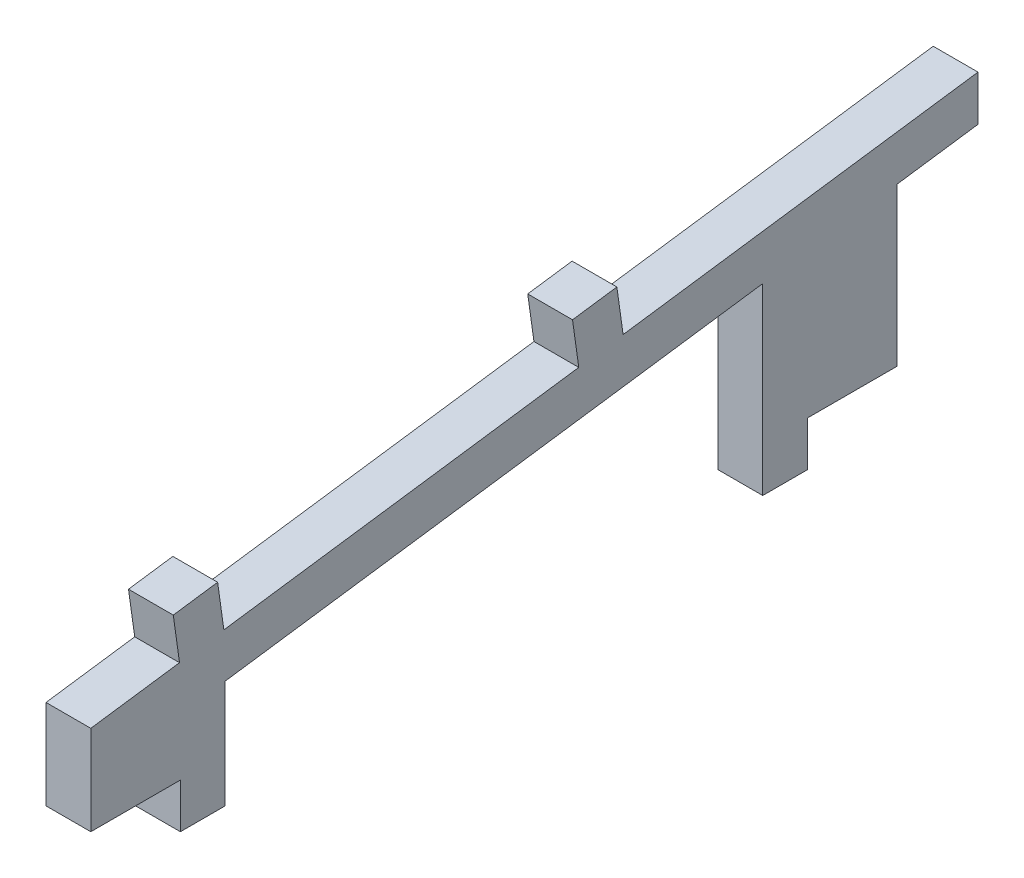
ISO-10303-21;
HEADER;
FILE_DESCRIPTION(('STEP AP214'),'2;1');
FILE_NAME('part.step','',(''),(''),'','','');
FILE_SCHEMA(('AUTOMOTIVE_DESIGN { 1 0 10303 214 1 1 1 1 }'));
ENDSEC;
DATA;
#1=APPLICATION_CONTEXT('core data for automotive mechanical design processes');
#2=APPLICATION_PROTOCOL_DEFINITION('international standard','automotive_design',2000,#1);
#3=PRODUCT_CONTEXT('',#1,'mechanical');
#4=PRODUCT('Part','Part','',(#3));
#5=PRODUCT_RELATED_PRODUCT_CATEGORY('part','',(#4));
#6=PRODUCT_DEFINITION_FORMATION('','',#4);
#7=PRODUCT_DEFINITION_CONTEXT('part definition',#1,'design');
#8=PRODUCT_DEFINITION('design','',#6,#7);
#9=PRODUCT_DEFINITION_SHAPE('','',#8);
#10=(LENGTH_UNIT() NAMED_UNIT(*) SI_UNIT(.MILLI.,.METRE.));
#11=(NAMED_UNIT(*) PLANE_ANGLE_UNIT() SI_UNIT($,.RADIAN.));
#12=(NAMED_UNIT(*) SI_UNIT($,.STERADIAN.) SOLID_ANGLE_UNIT());
#13=UNCERTAINTY_MEASURE_WITH_UNIT(LENGTH_MEASURE(1.E-05),#10,'distance_accuracy_value','');
#14=(GEOMETRIC_REPRESENTATION_CONTEXT(3) GLOBAL_UNCERTAINTY_ASSIGNED_CONTEXT((#13)) GLOBAL_UNIT_ASSIGNED_CONTEXT((#10,
#11,#12)) REPRESENTATION_CONTEXT('',''));
#15=CARTESIAN_POINT('',(0.,0.,0.));
#16=DIRECTION('',(0.,0.,1.));
#17=DIRECTION('',(1.,0.,0.));
#18=AXIS2_PLACEMENT_3D('',#15,#16,#17);
#19=CARTESIAN_POINT('',(5.,0.,0.));
#20=DIRECTION('',(0.,1.,0.));
#21=DIRECTION('',(0.,0.,1.));
#22=AXIS2_PLACEMENT_3D('',#19,#20,#21);
#23=PLANE('',#22);
#24=DIRECTION('',(0.,0.,-1.));
#25=VECTOR('',#24,1.);
#26=CARTESIAN_POINT('',(0.,0.,0.));
#27=LINE('',#26,#25);
#28=CARTESIAN_POINT('',(0.,0.,0.));
#29=VERTEX_POINT('',#28);
#30=CARTESIAN_POINT('',(0.,0.,-10.));
#31=VERTEX_POINT('',#30);
#32=EDGE_CURVE('E215',#29,#31,#27,.T.);
#33=ORIENTED_EDGE('',*,*,#32,.T.);
#34=DIRECTION('',(-1.,0.,0.));
#35=VECTOR('',#34,1.);
#36=CARTESIAN_POINT('',(5.,0.,-10.));
#37=LINE('',#36,#35);
#38=CARTESIAN_POINT('',(5.,0.,-10.));
#39=VERTEX_POINT('',#38);
#40=EDGE_CURVE('E11',#39,#31,#37,.T.);
#41=ORIENTED_EDGE('',*,*,#40,.F.);
#42=DIRECTION('',(0.,0.,-1.));
#43=VECTOR('',#42,1.);
#44=CARTESIAN_POINT('',(5.,0.,0.));
#45=LINE('',#44,#43);
#46=CARTESIAN_POINT('',(5.,0.,0.));
#47=VERTEX_POINT('',#46);
#48=EDGE_CURVE('E257',#47,#39,#45,.T.);
#49=ORIENTED_EDGE('',*,*,#48,.F.);
#50=DIRECTION('',(-1.,0.,0.));
#51=VECTOR('',#50,1.);
#52=CARTESIAN_POINT('',(5.,0.,0.));
#53=LINE('',#52,#51);
#54=EDGE_CURVE('E211',#47,#29,#53,.T.);
#55=ORIENTED_EDGE('',*,*,#54,.T.);
#56=EDGE_LOOP('',(#33,#41,#49,#55));
#57=FACE_BOUND('',#56,.T.);
#58=ADVANCED_FACE('F35',(#57),#23,.F.);
#59=CARTESIAN_POINT('',(5.,0.,-10.));
#60=DIRECTION('',(0.,0.,-1.));
#61=DIRECTION('',(-1.,0.,0.));
#62=AXIS2_PLACEMENT_3D('',#59,#60,#61);
#63=PLANE('',#62);
#64=DIRECTION('',(0.,-1.,0.));
#65=VECTOR('',#64,1.);
#66=CARTESIAN_POINT('',(0.,0.,-10.));
#67=LINE('',#66,#65);
#68=CARTESIAN_POINT('',(0.,-5.,-10.));
#69=VERTEX_POINT('',#68);
#70=EDGE_CURVE('E218',#31,#69,#67,.T.);
#71=ORIENTED_EDGE('',*,*,#70,.T.);
#72=DIRECTION('',(-1.,0.,0.));
#73=VECTOR('',#72,1.);
#74=CARTESIAN_POINT('',(5.,-5.,-10.));
#75=LINE('',#74,#73);
#76=CARTESIAN_POINT('',(5.,-5.,-10.));
#77=VERTEX_POINT('',#76);
#78=EDGE_CURVE('E43',#77,#69,#75,.T.);
#79=ORIENTED_EDGE('',*,*,#78,.F.);
#80=DIRECTION('',(0.,-1.,0.));
#81=VECTOR('',#80,1.);
#82=CARTESIAN_POINT('',(5.,0.,-10.));
#83=LINE('',#82,#81);
#84=EDGE_CURVE('E136',#39,#77,#83,.T.);
#85=ORIENTED_EDGE('',*,*,#84,.F.);
#86=ORIENTED_EDGE('',*,*,#40,.T.);
#87=EDGE_LOOP('',(#71,#79,#85,#86));
#88=FACE_BOUND('',#87,.T.);
#89=ADVANCED_FACE('F385',(#88),#63,.F.);
#90=CARTESIAN_POINT('',(5.,-5.,-10.));
#91=DIRECTION('',(0.,1.,0.));
#92=DIRECTION('',(0.,0.,1.));
#93=AXIS2_PLACEMENT_3D('',#90,#91,#92);
#94=PLANE('',#93);
#95=DIRECTION('',(0.,0.,-1.));
#96=VECTOR('',#95,1.);
#97=CARTESIAN_POINT('',(0.,-5.,-10.));
#98=LINE('',#97,#96);
#99=CARTESIAN_POINT('',(0.,-5.,-15.));
#100=VERTEX_POINT('',#99);
#101=EDGE_CURVE('E220',#69,#100,#98,.T.);
#102=ORIENTED_EDGE('',*,*,#101,.T.);
#103=DIRECTION('',(-1.,0.,0.));
#104=VECTOR('',#103,1.);
#105=CARTESIAN_POINT('',(5.,-5.,-15.));
#106=LINE('',#105,#104);
#107=CARTESIAN_POINT('',(5.,-5.,-15.));
#108=VERTEX_POINT('',#107);
#109=EDGE_CURVE('E306',#108,#100,#106,.T.);
#110=ORIENTED_EDGE('',*,*,#109,.F.);
#111=DIRECTION('',(0.,0.,-1.));
#112=VECTOR('',#111,1.);
#113=CARTESIAN_POINT('',(5.,-5.,-10.));
#114=LINE('',#113,#112);
#115=EDGE_CURVE('E314',#77,#108,#114,.T.);
#116=ORIENTED_EDGE('',*,*,#115,.F.);
#117=ORIENTED_EDGE('',*,*,#78,.T.);
#118=EDGE_LOOP('',(#102,#110,#116,#117));
#119=FACE_BOUND('',#118,.T.);
#120=ADVANCED_FACE('F312',(#119),#94,.F.);
#121=CARTESIAN_POINT('',(5.,7.05897465794268,-15.));
#122=DIRECTION('',(0.,0.,1.));
#123=DIRECTION('',(0.,-1.,0.));
#124=AXIS2_PLACEMENT_3D('',#121,#122,#123);
#125=PLANE('',#124);
#126=DIRECTION('',(0.,1.,0.));
#127=VECTOR('',#126,1.);
#128=CARTESIAN_POINT('',(0.,7.05897465794268,-15.));
#129=LINE('',#128,#127);
#130=CARTESIAN_POINT('',(0.,7.05897465794268,-15.));
#131=VERTEX_POINT('',#130);
#132=EDGE_CURVE('E222',#100,#131,#129,.T.);
#133=ORIENTED_EDGE('',*,*,#132,.T.);
#134=DIRECTION('',(-1.,0.,0.));
#135=VECTOR('',#134,1.);
#136=CARTESIAN_POINT('',(5.,7.05897465794268,-15.));
#137=LINE('',#136,#135);
#138=CARTESIAN_POINT('',(5.,7.05897465794268,-15.));
#139=VERTEX_POINT('',#138);
#140=EDGE_CURVE('E303',#139,#131,#137,.T.);
#141=ORIENTED_EDGE('',*,*,#140,.F.);
#142=DIRECTION('',(0.,1.,0.));
#143=VECTOR('',#142,1.);
#144=CARTESIAN_POINT('',(5.,7.05897465794268,-15.));
#145=LINE('',#144,#143);
#146=EDGE_CURVE('E332',#108,#139,#145,.T.);
#147=ORIENTED_EDGE('',*,*,#146,.F.);
#148=ORIENTED_EDGE('',*,*,#109,.T.);
#149=EDGE_LOOP('',(#133,#141,#147,#148));
#150=FACE_BOUND('',#149,.T.);
#151=ADVANCED_FACE('F323',(#150),#125,.F.);
#152=CARTESIAN_POINT('',(5.,15.4914247400858,-75.));
#153=DIRECTION('',(0.,0.990268068741571,0.139173100960059));
#154=DIRECTION('',(0.,-0.139173100960059,0.990268068741571));
#155=AXIS2_PLACEMENT_3D('',#152,#153,#154);
#156=PLANE('',#155);
#157=DIRECTION('',(0.,0.139173100960059,-0.990268068741571));
#158=VECTOR('',#157,1.);
#159=CARTESIAN_POINT('',(0.,15.4914247400858,-75.));
#160=LINE('',#159,#158);
#161=CARTESIAN_POINT('',(0.,15.4914247400858,-75.));
#162=VERTEX_POINT('',#161);
#163=EDGE_CURVE('E224',#131,#162,#160,.T.);
#164=ORIENTED_EDGE('',*,*,#163,.T.);
#165=DIRECTION('',(-1.,0.,0.));
#166=VECTOR('',#165,1.);
#167=CARTESIAN_POINT('',(5.,15.4914247400858,-75.));
#168=LINE('',#167,#166);
#169=CARTESIAN_POINT('',(5.,15.4914247400858,-75.));
#170=VERTEX_POINT('',#169);
#171=EDGE_CURVE('E300',#170,#162,#168,.T.);
#172=ORIENTED_EDGE('',*,*,#171,.F.);
#173=DIRECTION('',(0.,0.139173100960059,-0.990268068741571));
#174=VECTOR('',#173,1.);
#175=CARTESIAN_POINT('',(5.,15.4914247400858,-75.));
#176=LINE('',#175,#174);
#177=EDGE_CURVE('E329',#139,#170,#176,.T.);
#178=ORIENTED_EDGE('',*,*,#177,.F.);
#179=ORIENTED_EDGE('',*,*,#140,.T.);
#180=EDGE_LOOP('',(#164,#172,#178,#179));
#181=FACE_BOUND('',#180,.T.);
#182=ADVANCED_FACE('F327',(#181),#156,.F.);
#183=CARTESIAN_POINT('',(5.,-5.,-75.));
#184=DIRECTION('',(0.,0.,-1.));
#185=DIRECTION('',(-1.,0.,0.));
#186=AXIS2_PLACEMENT_3D('',#183,#184,#185);
#187=PLANE('',#186);
#188=DIRECTION('',(0.,-1.,0.));
#189=VECTOR('',#188,1.);
#190=CARTESIAN_POINT('',(0.,-5.,-75.));
#191=LINE('',#190,#189);
#192=CARTESIAN_POINT('',(0.,-5.,-75.));
#193=VERTEX_POINT('',#192);
#194=EDGE_CURVE('E226',#162,#193,#191,.T.);
#195=ORIENTED_EDGE('',*,*,#194,.T.);
#196=DIRECTION('',(-1.,0.,0.));
#197=VECTOR('',#196,1.);
#198=CARTESIAN_POINT('',(5.,-5.,-75.));
#199=LINE('',#198,#197);
#200=CARTESIAN_POINT('',(5.,-5.,-75.));
#201=VERTEX_POINT('',#200);
#202=EDGE_CURVE('E297',#201,#193,#199,.T.);
#203=ORIENTED_EDGE('',*,*,#202,.F.);
#204=DIRECTION('',(0.,-1.,0.));
#205=VECTOR('',#204,1.);
#206=CARTESIAN_POINT('',(5.,-5.,-75.));
#207=LINE('',#206,#205);
#208=EDGE_CURVE('E331',#170,#201,#207,.T.);
#209=ORIENTED_EDGE('',*,*,#208,.F.);
#210=ORIENTED_EDGE('',*,*,#171,.T.);
#211=EDGE_LOOP('',(#195,#203,#209,#210));
#212=FACE_BOUND('',#211,.T.);
#213=ADVANCED_FACE('F398',(#212),#187,.F.);
#214=CARTESIAN_POINT('',(5.,-5.,-75.));
#215=DIRECTION('',(0.,1.,0.));
#216=DIRECTION('',(0.,0.,1.));
#217=AXIS2_PLACEMENT_3D('',#214,#215,#216);
#218=PLANE('',#217);
#219=DIRECTION('',(0.,0.,-1.));
#220=VECTOR('',#219,1.);
#221=CARTESIAN_POINT('',(0.,-5.,-75.));
#222=LINE('',#221,#220);
#223=CARTESIAN_POINT('',(0.,-5.,-80.));
#224=VERTEX_POINT('',#223);
#225=EDGE_CURVE('E228',#193,#224,#222,.T.);
#226=ORIENTED_EDGE('',*,*,#225,.T.);
#227=DIRECTION('',(-1.,0.,0.));
#228=VECTOR('',#227,1.);
#229=CARTESIAN_POINT('',(5.,-5.,-80.));
#230=LINE('',#229,#228);
#231=CARTESIAN_POINT('',(5.,-5.,-80.));
#232=VERTEX_POINT('',#231);
#233=EDGE_CURVE('E294',#232,#224,#230,.T.);
#234=ORIENTED_EDGE('',*,*,#233,.F.);
#235=DIRECTION('',(0.,0.,-1.));
#236=VECTOR('',#235,1.);
#237=CARTESIAN_POINT('',(5.,-5.,-75.));
#238=LINE('',#237,#236);
#239=EDGE_CURVE('E334',#201,#232,#238,.T.);
#240=ORIENTED_EDGE('',*,*,#239,.F.);
#241=ORIENTED_EDGE('',*,*,#202,.T.);
#242=EDGE_LOOP('',(#226,#234,#240,#241));
#243=FACE_BOUND('',#242,.T.);
#244=ADVANCED_FACE('F401',(#243),#218,.F.);
#245=CARTESIAN_POINT('',(5.,-5.,-80.));
#246=DIRECTION('',(0.,0.,1.));
#247=DIRECTION('',(1.,0.,0.));
#248=AXIS2_PLACEMENT_3D('',#245,#246,#247);
#249=PLANE('',#248);
#250=DIRECTION('',(0.,1.,0.));
#251=VECTOR('',#250,1.);
#252=CARTESIAN_POINT('',(0.,-5.,-80.));
#253=LINE('',#252,#251);
#254=CARTESIAN_POINT('',(0.,0.,-80.));
#255=VERTEX_POINT('',#254);
#256=EDGE_CURVE('E230',#224,#255,#253,.T.);
#257=ORIENTED_EDGE('',*,*,#256,.T.);
#258=DIRECTION('',(-1.,0.,0.));
#259=VECTOR('',#258,1.);
#260=CARTESIAN_POINT('',(5.,0.,-80.));
#261=LINE('',#260,#259);
#262=CARTESIAN_POINT('',(5.,0.,-80.));
#263=VERTEX_POINT('',#262);
#264=EDGE_CURVE('E291',#263,#255,#261,.T.);
#265=ORIENTED_EDGE('',*,*,#264,.F.);
#266=DIRECTION('',(0.,1.,0.));
#267=VECTOR('',#266,1.);
#268=CARTESIAN_POINT('',(5.,-5.,-80.));
#269=LINE('',#268,#267);
#270=EDGE_CURVE('E340',#232,#263,#269,.T.);
#271=ORIENTED_EDGE('',*,*,#270,.F.);
#272=ORIENTED_EDGE('',*,*,#233,.T.);
#273=EDGE_LOOP('',(#257,#265,#271,#272));
#274=FACE_BOUND('',#273,.T.);
#275=ADVANCED_FACE('F405',(#274),#249,.F.);
#276=CARTESIAN_POINT('',(5.,0.,-80.));
#277=DIRECTION('',(0.,1.,0.));
#278=DIRECTION('',(0.,0.,1.));
#279=AXIS2_PLACEMENT_3D('',#276,#277,#278);
#280=PLANE('',#279);
#281=DIRECTION('',(0.,0.,-1.));
#282=VECTOR('',#281,1.);
#283=CARTESIAN_POINT('',(0.,0.,-80.));
#284=LINE('',#283,#282);
#285=CARTESIAN_POINT('',(0.,0.,-90.));
#286=VERTEX_POINT('',#285);
#287=EDGE_CURVE('E232',#255,#286,#284,.T.);
#288=ORIENTED_EDGE('',*,*,#287,.T.);
#289=DIRECTION('',(-1.,0.,0.));
#290=VECTOR('',#289,1.);
#291=CARTESIAN_POINT('',(5.,0.,-90.));
#292=LINE('',#291,#290);
#293=CARTESIAN_POINT('',(5.,0.,-90.));
#294=VERTEX_POINT('',#293);
#295=EDGE_CURVE('E288',#294,#286,#292,.T.);
#296=ORIENTED_EDGE('',*,*,#295,.F.);
#297=DIRECTION('',(0.,0.,-1.));
#298=VECTOR('',#297,1.);
#299=CARTESIAN_POINT('',(5.,0.,-80.));
#300=LINE('',#299,#298);
#301=EDGE_CURVE('E342',#263,#294,#300,.T.);
#302=ORIENTED_EDGE('',*,*,#301,.F.);
#303=ORIENTED_EDGE('',*,*,#264,.T.);
#304=EDGE_LOOP('',(#288,#296,#302,#303));
#305=FACE_BOUND('',#304,.T.);
#306=ADVANCED_FACE('F409',(#305),#280,.F.);
#307=CARTESIAN_POINT('',(5.,17.5995372606215,-90.));
#308=DIRECTION('',(0.,0.,1.));
#309=DIRECTION('',(1.,0.,0.));
#310=AXIS2_PLACEMENT_3D('',#307,#308,#309);
#311=PLANE('',#310);
#312=DIRECTION('',(0.,1.,0.));
#313=VECTOR('',#312,1.);
#314=CARTESIAN_POINT('',(0.,17.5995372606215,-90.));
#315=LINE('',#314,#313);
#316=CARTESIAN_POINT('',(0.,17.5995372606215,-90.));
#317=VERTEX_POINT('',#316);
#318=EDGE_CURVE('E234',#286,#317,#315,.T.);
#319=ORIENTED_EDGE('',*,*,#318,.T.);
#320=DIRECTION('',(-1.,0.,0.));
#321=VECTOR('',#320,1.);
#322=CARTESIAN_POINT('',(5.,17.5995372606215,-90.));
#323=LINE('',#322,#321);
#324=CARTESIAN_POINT('',(5.,17.5995372606215,-90.));
#325=VERTEX_POINT('',#324);
#326=EDGE_CURVE('E285',#325,#317,#323,.T.);
#327=ORIENTED_EDGE('',*,*,#326,.F.);
#328=DIRECTION('',(0.,1.,0.));
#329=VECTOR('',#328,1.);
#330=CARTESIAN_POINT('',(5.,17.5995372606215,-90.));
#331=LINE('',#330,#329);
#332=EDGE_CURVE('E344',#294,#325,#331,.T.);
#333=ORIENTED_EDGE('',*,*,#332,.F.);
#334=ORIENTED_EDGE('',*,*,#295,.T.);
#335=EDGE_LOOP('',(#319,#327,#333,#334));
#336=FACE_BOUND('',#335,.T.);
#337=ADVANCED_FACE('F413',(#336),#311,.F.);
#338=CARTESIAN_POINT('',(5.,18.8681722334128,-99.0268068741571));
#339=DIRECTION('',(0.,0.990268068741571,0.139173100960059));
#340=DIRECTION('',(0.,-0.139173100960059,0.990268068741571));
#341=AXIS2_PLACEMENT_3D('',#338,#339,#340);
#342=PLANE('',#341);
#343=DIRECTION('',(0.,0.139173100960059,-0.990268068741571));
#344=VECTOR('',#343,1.);
#345=CARTESIAN_POINT('',(0.,18.8681722334128,-99.0268068741571));
#346=LINE('',#345,#344);
#347=CARTESIAN_POINT('',(0.,18.8681722334128,-99.0268068741571));
#348=VERTEX_POINT('',#347);
#349=EDGE_CURVE('E236',#317,#348,#346,.T.);
#350=ORIENTED_EDGE('',*,*,#349,.T.);
#351=DIRECTION('',(-1.,0.,0.));
#352=VECTOR('',#351,1.);
#353=CARTESIAN_POINT('',(5.,18.8681722334128,-99.0268068741571));
#354=LINE('',#353,#352);
#355=CARTESIAN_POINT('',(5.,18.8681722334128,-99.0268068741571));
#356=VERTEX_POINT('',#355);
#357=EDGE_CURVE('E282',#356,#348,#354,.T.);
#358=ORIENTED_EDGE('',*,*,#357,.F.);
#359=DIRECTION('',(0.,0.139173100960059,-0.990268068741571));
#360=VECTOR('',#359,1.);
#361=CARTESIAN_POINT('',(5.,18.8681722334128,-99.0268068741571));
#362=LINE('',#361,#360);
#363=EDGE_CURVE('E346',#325,#356,#362,.T.);
#364=ORIENTED_EDGE('',*,*,#363,.F.);
#365=ORIENTED_EDGE('',*,*,#326,.T.);
#366=EDGE_LOOP('',(#350,#358,#364,#365));
#367=FACE_BOUND('',#366,.T.);
#368=ADVANCED_FACE('F417',(#367),#342,.F.);
#369=CARTESIAN_POINT('',(5.,23.9173100960059,-99.0268068741571));
#370=DIRECTION('',(0.,0.,1.));
#371=DIRECTION('',(1.,0.,0.));
#372=AXIS2_PLACEMENT_3D('',#369,#370,#371);
#373=PLANE('',#372);
#374=DIRECTION('',(0.,1.,0.));
#375=VECTOR('',#374,1.);
#376=CARTESIAN_POINT('',(0.,23.9173100960059,-99.0268068741571));
#377=LINE('',#376,#375);
#378=CARTESIAN_POINT('',(0.,23.9173100960059,-99.0268068741571));
#379=VERTEX_POINT('',#378);
#380=EDGE_CURVE('E238',#348,#379,#377,.T.);
#381=ORIENTED_EDGE('',*,*,#380,.T.);
#382=DIRECTION('',(-1.,0.,0.));
#383=VECTOR('',#382,1.);
#384=CARTESIAN_POINT('',(5.,23.9173100960059,-99.0268068741571));
#385=LINE('',#384,#383);
#386=CARTESIAN_POINT('',(5.,23.9173100960059,-99.0268068741571));
#387=VERTEX_POINT('',#386);
#388=EDGE_CURVE('E279',#387,#379,#385,.T.);
#389=ORIENTED_EDGE('',*,*,#388,.F.);
#390=DIRECTION('',(0.,1.,0.));
#391=VECTOR('',#390,1.);
#392=CARTESIAN_POINT('',(5.,23.9173100960059,-99.0268068741571));
#393=LINE('',#392,#391);
#394=EDGE_CURVE('E348',#356,#387,#393,.T.);
#395=ORIENTED_EDGE('',*,*,#394,.F.);
#396=ORIENTED_EDGE('',*,*,#357,.T.);
#397=EDGE_LOOP('',(#381,#389,#395,#396));
#398=FACE_BOUND('',#397,.T.);
#399=ADVANCED_FACE('F421',(#398),#373,.F.);
#400=CARTESIAN_POINT('',(5.,18.3503860576035,-59.4160841244943));
#401=DIRECTION('',(0.,-0.990268068741571,-0.139173100960059));
#402=DIRECTION('',(0.,0.139173100960059,-0.990268068741571));
#403=AXIS2_PLACEMENT_3D('',#400,#401,#402);
#404=PLANE('',#403);
#405=DIRECTION('',(0.,-0.139173100960059,0.990268068741571));
#406=VECTOR('',#405,1.);
#407=CARTESIAN_POINT('',(0.,18.3503860576035,-59.4160841244943));
#408=LINE('',#407,#406);
#409=CARTESIAN_POINT('',(0.,18.3503860576035,-59.4160841244943));
#410=VERTEX_POINT('',#409);
#411=EDGE_CURVE('E240',#379,#410,#408,.T.);
#412=ORIENTED_EDGE('',*,*,#411,.T.);
#413=DIRECTION('',(-1.,0.,0.));
#414=VECTOR('',#413,1.);
#415=CARTESIAN_POINT('',(5.,18.3503860576035,-59.4160841244943));
#416=LINE('',#415,#414);
#417=CARTESIAN_POINT('',(5.,18.3503860576035,-59.4160841244943));
#418=VERTEX_POINT('',#417);
#419=EDGE_CURVE('E276',#418,#410,#416,.T.);
#420=ORIENTED_EDGE('',*,*,#419,.F.);
#421=DIRECTION('',(0.,-0.139173100960059,0.990268068741571));
#422=VECTOR('',#421,1.);
#423=CARTESIAN_POINT('',(5.,18.3503860576035,-59.4160841244943));
#424=LINE('',#423,#422);
#425=EDGE_CURVE('E350',#387,#418,#424,.T.);
#426=ORIENTED_EDGE('',*,*,#425,.F.);
#427=ORIENTED_EDGE('',*,*,#388,.T.);
#428=EDGE_LOOP('',(#412,#420,#426,#427));
#429=FACE_BOUND('',#428,.T.);
#430=ADVANCED_FACE('F425',(#429),#404,.F.);
#431=CARTESIAN_POINT('',(5.,23.3017264013114,-58.720218619694));
#432=DIRECTION('',(0.,-0.139173100960059,0.990268068741571));
#433=DIRECTION('',(0.,-0.990268068741571,-0.139173100960059));
#434=AXIS2_PLACEMENT_3D('',#431,#432,#433);
#435=PLANE('',#434);
#436=DIRECTION('',(0.,0.990268068741571,0.139173100960059));
#437=VECTOR('',#436,1.);
#438=CARTESIAN_POINT('',(0.,23.3017264013114,-58.720218619694));
#439=LINE('',#438,#437);
#440=CARTESIAN_POINT('',(0.,23.3017264013114,-58.720218619694));
#441=VERTEX_POINT('',#440);
#442=EDGE_CURVE('E242',#410,#441,#439,.T.);
#443=ORIENTED_EDGE('',*,*,#442,.T.);
#444=DIRECTION('',(-1.,0.,0.));
#445=VECTOR('',#444,1.);
#446=CARTESIAN_POINT('',(5.,23.3017264013114,-58.720218619694));
#447=LINE('',#446,#445);
#448=CARTESIAN_POINT('',(5.,23.3017264013114,-58.720218619694));
#449=VERTEX_POINT('',#448);
#450=EDGE_CURVE('E273',#449,#441,#447,.T.);
#451=ORIENTED_EDGE('',*,*,#450,.F.);
#452=DIRECTION('',(0.,0.990268068741571,0.139173100960059));
#453=VECTOR('',#452,1.);
#454=CARTESIAN_POINT('',(5.,23.3017264013114,-58.720218619694));
#455=LINE('',#454,#453);
#456=EDGE_CURVE('E352',#418,#449,#455,.T.);
#457=ORIENTED_EDGE('',*,*,#456,.F.);
#458=ORIENTED_EDGE('',*,*,#419,.T.);
#459=EDGE_LOOP('',(#443,#451,#457,#458));
#460=FACE_BOUND('',#459,.T.);
#461=ADVANCED_FACE('F429',(#460),#435,.F.);
#462=CARTESIAN_POINT('',(5.,22.6058608965111,-53.7688782759861));
#463=DIRECTION('',(0.,-0.990268068741571,-0.139173100960061));
#464=DIRECTION('',(0.,0.139173100960061,-0.990268068741571));
#465=AXIS2_PLACEMENT_3D('',#462,#463,#464);
#466=PLANE('',#465);
#467=DIRECTION('',(0.,-0.139173100960061,0.990268068741571));
#468=VECTOR('',#467,1.);
#469=CARTESIAN_POINT('',(0.,22.6058608965111,-53.7688782759861));
#470=LINE('',#469,#468);
#471=CARTESIAN_POINT('',(0.,22.6058608965111,-53.7688782759861));
#472=VERTEX_POINT('',#471);
#473=EDGE_CURVE('E244',#441,#472,#470,.T.);
#474=ORIENTED_EDGE('',*,*,#473,.T.);
#475=DIRECTION('',(-1.,0.,0.));
#476=VECTOR('',#475,1.);
#477=CARTESIAN_POINT('',(5.,22.6058608965111,-53.7688782759861));
#478=LINE('',#477,#476);
#479=CARTESIAN_POINT('',(5.,22.6058608965111,-53.7688782759861));
#480=VERTEX_POINT('',#479);
#481=EDGE_CURVE('E270',#480,#472,#478,.T.);
#482=ORIENTED_EDGE('',*,*,#481,.F.);
#483=DIRECTION('',(0.,-0.139173100960061,0.990268068741571));
#484=VECTOR('',#483,1.);
#485=CARTESIAN_POINT('',(5.,22.6058608965111,-53.7688782759861));
#486=LINE('',#485,#484);
#487=EDGE_CURVE('E354',#449,#480,#486,.T.);
#488=ORIENTED_EDGE('',*,*,#487,.F.);
#489=ORIENTED_EDGE('',*,*,#450,.T.);
#490=EDGE_LOOP('',(#474,#482,#488,#489));
#491=FACE_BOUND('',#490,.T.);
#492=ADVANCED_FACE('F433',(#491),#466,.F.);
#493=CARTESIAN_POINT('',(5.,17.6545205528032,-54.4647437807864));
#494=DIRECTION('',(0.,0.139173100960061,-0.990268068741571));
#495=DIRECTION('',(0.,0.990268068741571,0.139173100960061));
#496=AXIS2_PLACEMENT_3D('',#493,#494,#495);
#497=PLANE('',#496);
#498=DIRECTION('',(0.,-0.990268068741571,-0.139173100960061));
#499=VECTOR('',#498,1.);
#500=CARTESIAN_POINT('',(0.,17.6545205528032,-54.4647437807864));
#501=LINE('',#500,#499);
#502=CARTESIAN_POINT('',(0.,17.6545205528032,-54.4647437807864));
#503=VERTEX_POINT('',#502);
#504=EDGE_CURVE('E246',#472,#503,#501,.T.);
#505=ORIENTED_EDGE('',*,*,#504,.T.);
#506=DIRECTION('',(-1.,0.,0.));
#507=VECTOR('',#506,1.);
#508=CARTESIAN_POINT('',(5.,17.6545205528032,-54.4647437807864));
#509=LINE('',#508,#507);
#510=CARTESIAN_POINT('',(5.,17.6545205528032,-54.4647437807864));
#511=VERTEX_POINT('',#510);
#512=EDGE_CURVE('E267',#511,#503,#509,.T.);
#513=ORIENTED_EDGE('',*,*,#512,.F.);
#514=DIRECTION('',(0.,-0.990268068741571,-0.139173100960061));
#515=VECTOR('',#514,1.);
#516=CARTESIAN_POINT('',(5.,17.6545205528032,-54.4647437807864));
#517=LINE('',#516,#515);
#518=EDGE_CURVE('E356',#480,#511,#517,.T.);
#519=ORIENTED_EDGE('',*,*,#518,.F.);
#520=ORIENTED_EDGE('',*,*,#481,.T.);
#521=EDGE_LOOP('',(#505,#513,#519,#520));
#522=FACE_BOUND('',#521,.T.);
#523=ADVANCED_FACE('F437',(#522),#497,.F.);
#524=CARTESIAN_POINT('',(5.,12.0875965144009,-14.8540210311236));
#525=DIRECTION('',(0.,-0.990268068741571,-0.139173100960059));
#526=DIRECTION('',(0.,0.139173100960059,-0.990268068741571));
#527=AXIS2_PLACEMENT_3D('',#524,#525,#526);
#528=PLANE('',#527);
#529=DIRECTION('',(0.,-0.139173100960059,0.990268068741571));
#530=VECTOR('',#529,1.);
#531=CARTESIAN_POINT('',(0.,12.0875965144009,-14.8540210311236));
#532=LINE('',#531,#530);
#533=CARTESIAN_POINT('',(0.,12.0875965144009,-14.8540210311236));
#534=VERTEX_POINT('',#533);
#535=EDGE_CURVE('E248',#503,#534,#532,.T.);
#536=ORIENTED_EDGE('',*,*,#535,.T.);
#537=DIRECTION('',(-1.,0.,0.));
#538=VECTOR('',#537,1.);
#539=CARTESIAN_POINT('',(5.,12.0875965144009,-14.8540210311236));
#540=LINE('',#539,#538);
#541=CARTESIAN_POINT('',(5.,12.0875965144009,-14.8540210311236));
#542=VERTEX_POINT('',#541);
#543=EDGE_CURVE('E264',#542,#534,#540,.T.);
#544=ORIENTED_EDGE('',*,*,#543,.F.);
#545=DIRECTION('',(0.,-0.139173100960059,0.990268068741571));
#546=VECTOR('',#545,1.);
#547=CARTESIAN_POINT('',(5.,12.0875965144009,-14.8540210311236));
#548=LINE('',#547,#546);
#549=EDGE_CURVE('E358',#511,#542,#548,.T.);
#550=ORIENTED_EDGE('',*,*,#549,.F.);
#551=ORIENTED_EDGE('',*,*,#512,.T.);
#552=EDGE_LOOP('',(#536,#544,#550,#551));
#553=FACE_BOUND('',#552,.T.);
#554=ADVANCED_FACE('F441',(#553),#528,.F.);
#555=CARTESIAN_POINT('',(5.,17.0389368581087,-14.1581555263233));
#556=DIRECTION('',(0.,-0.13917310096006,0.990268068741571));
#557=DIRECTION('',(0.,-0.990268068741571,-0.13917310096006));
#558=AXIS2_PLACEMENT_3D('',#555,#556,#557);
#559=PLANE('',#558);
#560=DIRECTION('',(0.,0.990268068741571,0.13917310096006));
#561=VECTOR('',#560,1.);
#562=CARTESIAN_POINT('',(0.,17.0389368581087,-14.1581555263233));
#563=LINE('',#562,#561);
#564=CARTESIAN_POINT('',(0.,17.0389368581087,-14.1581555263233));
#565=VERTEX_POINT('',#564);
#566=EDGE_CURVE('E250',#534,#565,#563,.T.);
#567=ORIENTED_EDGE('',*,*,#566,.T.);
#568=DIRECTION('',(-1.,0.,0.));
#569=VECTOR('',#568,1.);
#570=CARTESIAN_POINT('',(5.,17.0389368581087,-14.1581555263233));
#571=LINE('',#570,#569);
#572=CARTESIAN_POINT('',(5.,17.0389368581087,-14.1581555263233));
#573=VERTEX_POINT('',#572);
#574=EDGE_CURVE('E261',#573,#565,#571,.T.);
#575=ORIENTED_EDGE('',*,*,#574,.F.);
#576=DIRECTION('',(0.,0.990268068741571,0.13917310096006));
#577=VECTOR('',#576,1.);
#578=CARTESIAN_POINT('',(5.,17.0389368581087,-14.1581555263233));
#579=LINE('',#578,#577);
#580=EDGE_CURVE('E360',#542,#573,#579,.T.);
#581=ORIENTED_EDGE('',*,*,#580,.F.);
#582=ORIENTED_EDGE('',*,*,#543,.T.);
#583=EDGE_LOOP('',(#567,#575,#581,#582));
#584=FACE_BOUND('',#583,.T.);
#585=ADVANCED_FACE('F366',(#584),#559,.F.);
#586=CARTESIAN_POINT('',(5.,16.3430713533084,-9.20681518261542));
#587=DIRECTION('',(0.,-0.990268068741571,-0.139173100960059));
#588=DIRECTION('',(0.,0.139173100960059,-0.990268068741571));
#589=AXIS2_PLACEMENT_3D('',#586,#587,#588);
#590=PLANE('',#589);
#591=DIRECTION('',(0.,-0.139173100960059,0.990268068741571));
#592=VECTOR('',#591,1.);
#593=CARTESIAN_POINT('',(0.,16.3430713533084,-9.20681518261542));
#594=LINE('',#593,#592);
#595=CARTESIAN_POINT('',(0.,16.3430713533084,-9.20681518261542));
#596=VERTEX_POINT('',#595);
#597=EDGE_CURVE('E252',#565,#596,#594,.T.);
#598=ORIENTED_EDGE('',*,*,#597,.T.);
#599=DIRECTION('',(-1.,0.,0.));
#600=VECTOR('',#599,1.);
#601=CARTESIAN_POINT('',(5.,16.3430713533084,-9.20681518261542));
#602=LINE('',#601,#600);
#603=CARTESIAN_POINT('',(5.,16.3430713533084,-9.20681518261542));
#604=VERTEX_POINT('',#603);
#605=EDGE_CURVE('E206',#604,#596,#602,.T.);
#606=ORIENTED_EDGE('',*,*,#605,.F.);
#607=DIRECTION('',(0.,-0.139173100960059,0.990268068741571));
#608=VECTOR('',#607,1.);
#609=CARTESIAN_POINT('',(5.,16.3430713533084,-9.20681518261542));
#610=LINE('',#609,#608);
#611=EDGE_CURVE('E197',#573,#604,#610,.T.);
#612=ORIENTED_EDGE('',*,*,#611,.F.);
#613=ORIENTED_EDGE('',*,*,#574,.T.);
#614=EDGE_LOOP('',(#598,#606,#612,#613));
#615=FACE_BOUND('',#614,.T.);
#616=ADVANCED_FACE('F370',(#615),#590,.F.);
#617=CARTESIAN_POINT('',(5.,11.3917310096006,-9.90268068741572));
#618=DIRECTION('',(0.,0.139173100960059,-0.990268068741571));
#619=DIRECTION('',(0.,0.990268068741571,0.139173100960059));
#620=AXIS2_PLACEMENT_3D('',#617,#618,#619);
#621=PLANE('',#620);
#622=DIRECTION('',(0.,-0.990268068741571,-0.139173100960059));
#623=VECTOR('',#622,1.);
#624=CARTESIAN_POINT('',(0.,11.3917310096006,-9.90268068741572));
#625=LINE('',#624,#623);
#626=CARTESIAN_POINT('',(0.,11.3917310096006,-9.90268068741572));
#627=VERTEX_POINT('',#626);
#628=EDGE_CURVE('E205',#596,#627,#625,.T.);
#629=ORIENTED_EDGE('',*,*,#628,.T.);
#630=DIRECTION('',(-1.,0.,0.));
#631=VECTOR('',#630,1.);
#632=CARTESIAN_POINT('',(5.,11.3917310096006,-9.90268068741572));
#633=LINE('',#632,#631);
#634=CARTESIAN_POINT('',(5.,11.3917310096006,-9.90268068741572));
#635=VERTEX_POINT('',#634);
#636=EDGE_CURVE('E202',#635,#627,#633,.T.);
#637=ORIENTED_EDGE('',*,*,#636,.F.);
#638=DIRECTION('',(0.,-0.990268068741571,-0.139173100960059));
#639=VECTOR('',#638,1.);
#640=CARTESIAN_POINT('',(5.,11.3917310096006,-9.90268068741572));
#641=LINE('',#640,#639);
#642=EDGE_CURVE('E191',#604,#635,#641,.T.);
#643=ORIENTED_EDGE('',*,*,#642,.F.);
#644=ORIENTED_EDGE('',*,*,#605,.T.);
#645=EDGE_LOOP('',(#629,#637,#643,#644));
#646=FACE_BOUND('',#645,.T.);
#647=ADVANCED_FACE('F203',(#646),#621,.F.);
#648=CARTESIAN_POINT('',(5.,10.,0.));
#649=DIRECTION('',(0.,-0.990268068741571,-0.139173100960059));
#650=DIRECTION('',(0.,0.139173100960059,-0.990268068741571));
#651=AXIS2_PLACEMENT_3D('',#648,#649,#650);
#652=PLANE('',#651);
#653=DIRECTION('',(0.,-0.139173100960059,0.990268068741571));
#654=VECTOR('',#653,1.);
#655=CARTESIAN_POINT('',(0.,10.,0.));
#656=LINE('',#655,#654);
#657=CARTESIAN_POINT('',(0.,10.,0.));
#658=VERTEX_POINT('',#657);
#659=EDGE_CURVE('E122',#627,#658,#656,.T.);
#660=ORIENTED_EDGE('',*,*,#659,.T.);
#661=DIRECTION('',(-1.,0.,0.));
#662=VECTOR('',#661,1.);
#663=CARTESIAN_POINT('',(5.,10.,0.));
#664=LINE('',#663,#662);
#665=CARTESIAN_POINT('',(5.,10.,0.));
#666=VERTEX_POINT('',#665);
#667=EDGE_CURVE('E207',#666,#658,#664,.T.);
#668=ORIENTED_EDGE('',*,*,#667,.F.);
#669=DIRECTION('',(0.,-0.139173100960059,0.990268068741571));
#670=VECTOR('',#669,1.);
#671=CARTESIAN_POINT('',(5.,10.,0.));
#672=LINE('',#671,#670);
#673=EDGE_CURVE('E195',#635,#666,#672,.T.);
#674=ORIENTED_EDGE('',*,*,#673,.F.);
#675=ORIENTED_EDGE('',*,*,#636,.T.);
#676=EDGE_LOOP('',(#660,#668,#674,#675));
#677=FACE_BOUND('',#676,.T.);
#678=ADVANCED_FACE('F209',(#677),#652,.F.);
#679=CARTESIAN_POINT('',(5.,0.,0.));
#680=DIRECTION('',(0.,0.,-1.));
#681=DIRECTION('',(-1.,0.,0.));
#682=AXIS2_PLACEMENT_3D('',#679,#680,#681);
#683=PLANE('',#682);
#684=DIRECTION('',(0.,-1.,0.));
#685=VECTOR('',#684,1.);
#686=CARTESIAN_POINT('',(0.,0.,0.));
#687=LINE('',#686,#685);
#688=EDGE_CURVE('E128',#658,#29,#687,.T.);
#689=ORIENTED_EDGE('',*,*,#688,.T.);
#690=ORIENTED_EDGE('',*,*,#54,.F.);
#691=DIRECTION('',(0.,-1.,0.));
#692=VECTOR('',#691,1.);
#693=CARTESIAN_POINT('',(5.,0.,0.));
#694=LINE('',#693,#692);
#695=EDGE_CURVE('E51',#666,#47,#694,.T.);
#696=ORIENTED_EDGE('',*,*,#695,.F.);
#697=ORIENTED_EDGE('',*,*,#667,.T.);
#698=EDGE_LOOP('',(#689,#690,#696,#697));
#699=FACE_BOUND('',#698,.T.);
#700=ADVANCED_FACE('F374',(#699),#683,.F.);
#701=CARTESIAN_POINT('',(5.,0.,0.));
#702=DIRECTION('',(-1.,0.,0.));
#703=DIRECTION('',(0.,0.,1.));
#704=AXIS2_PLACEMENT_3D('',#701,#702,#703);
#705=PLANE('',#704);
#706=ORIENTED_EDGE('',*,*,#48,.T.);
#707=ORIENTED_EDGE('',*,*,#84,.T.);
#708=ORIENTED_EDGE('',*,*,#115,.T.);
#709=ORIENTED_EDGE('',*,*,#146,.T.);
#710=ORIENTED_EDGE('',*,*,#177,.T.);
#711=ORIENTED_EDGE('',*,*,#208,.T.);
#712=ORIENTED_EDGE('',*,*,#239,.T.);
#713=ORIENTED_EDGE('',*,*,#270,.T.);
#714=ORIENTED_EDGE('',*,*,#301,.T.);
#715=ORIENTED_EDGE('',*,*,#332,.T.);
#716=ORIENTED_EDGE('',*,*,#363,.T.);
#717=ORIENTED_EDGE('',*,*,#394,.T.);
#718=ORIENTED_EDGE('',*,*,#425,.T.);
#719=ORIENTED_EDGE('',*,*,#456,.T.);
#720=ORIENTED_EDGE('',*,*,#487,.T.);
#721=ORIENTED_EDGE('',*,*,#518,.T.);
#722=ORIENTED_EDGE('',*,*,#549,.T.);
#723=ORIENTED_EDGE('',*,*,#580,.T.);
#724=ORIENTED_EDGE('',*,*,#611,.T.);
#725=ORIENTED_EDGE('',*,*,#642,.T.);
#726=ORIENTED_EDGE('',*,*,#673,.T.);
#727=ORIENTED_EDGE('',*,*,#695,.T.);
#728=EDGE_LOOP('',(#706,#707,#708,#709,#710,#711,#712,#713,#714,#715,#716,#717,#718,#719,#720,
#721,#722,#723,#724,#725,#726,#727));
#729=FACE_BOUND('',#728,.T.);
#730=ADVANCED_FACE('F193',(#729),#705,.F.);
#731=CARTESIAN_POINT('',(0.,0.,0.));
#732=DIRECTION('',(-1.,0.,0.));
#733=DIRECTION('',(0.,0.,1.));
#734=AXIS2_PLACEMENT_3D('',#731,#732,#733);
#735=PLANE('',#734);
#736=ORIENTED_EDGE('',*,*,#32,.F.);
#737=ORIENTED_EDGE('',*,*,#688,.F.);
#738=ORIENTED_EDGE('',*,*,#659,.F.);
#739=ORIENTED_EDGE('',*,*,#628,.F.);
#740=ORIENTED_EDGE('',*,*,#597,.F.);
#741=ORIENTED_EDGE('',*,*,#566,.F.);
#742=ORIENTED_EDGE('',*,*,#535,.F.);
#743=ORIENTED_EDGE('',*,*,#504,.F.);
#744=ORIENTED_EDGE('',*,*,#473,.F.);
#745=ORIENTED_EDGE('',*,*,#442,.F.);
#746=ORIENTED_EDGE('',*,*,#411,.F.);
#747=ORIENTED_EDGE('',*,*,#380,.F.);
#748=ORIENTED_EDGE('',*,*,#349,.F.);
#749=ORIENTED_EDGE('',*,*,#318,.F.);
#750=ORIENTED_EDGE('',*,*,#287,.F.);
#751=ORIENTED_EDGE('',*,*,#256,.F.);
#752=ORIENTED_EDGE('',*,*,#225,.F.);
#753=ORIENTED_EDGE('',*,*,#194,.F.);
#754=ORIENTED_EDGE('',*,*,#163,.F.);
#755=ORIENTED_EDGE('',*,*,#132,.F.);
#756=ORIENTED_EDGE('',*,*,#101,.F.);
#757=ORIENTED_EDGE('',*,*,#70,.F.);
#758=EDGE_LOOP('',(#736,#737,#738,#739,#740,#741,#742,#743,#744,#745,#746,#747,#748,#749,#750,
#751,#752,#753,#754,#755,#756,#757));
#759=FACE_BOUND('',#758,.T.);
#760=ADVANCED_FACE('F318',(#759),#735,.T.);
#761=CLOSED_SHELL('',(#58,#89,#120,#151,#182,#213,#244,#275,#306,#337,#368,#399,#430,#461,#492,
#523,#554,#585,#616,#647,#678,#700,#730,#760));
#762=MANIFOLD_SOLID_BREP('B2',#761);
#763=ADVANCED_BREP_SHAPE_REPRESENTATION('',(#18,#762),#14);
#764=SHAPE_DEFINITION_REPRESENTATION(#9,#763);
ENDSEC;
END-ISO-10303-21;
